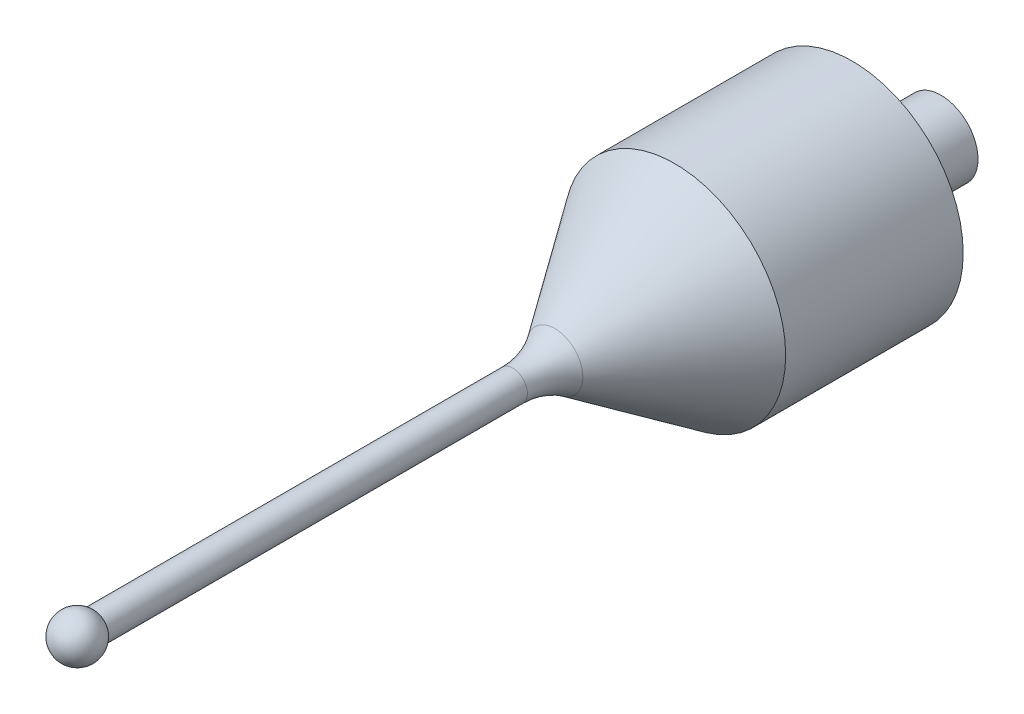
ISO-10303-21;
HEADER;
FILE_DESCRIPTION(('STEP AP214'),'2;1');
FILE_NAME('part.step','',(''),(''),'','','');
FILE_SCHEMA(('AUTOMOTIVE_DESIGN { 1 0 10303 214 1 1 1 1 }'));
ENDSEC;
DATA;
#1=APPLICATION_CONTEXT('core data for automotive mechanical design processes');
#2=APPLICATION_PROTOCOL_DEFINITION('international standard','automotive_design',2000,#1);
#3=PRODUCT_CONTEXT('',#1,'mechanical');
#4=PRODUCT('Part','Part','',(#3));
#5=PRODUCT_RELATED_PRODUCT_CATEGORY('part','',(#4));
#6=PRODUCT_DEFINITION_FORMATION('','',#4);
#7=PRODUCT_DEFINITION_CONTEXT('part definition',#1,'design');
#8=PRODUCT_DEFINITION('design','',#6,#7);
#9=PRODUCT_DEFINITION_SHAPE('','',#8);
#10=(LENGTH_UNIT() NAMED_UNIT(*) SI_UNIT(.MILLI.,.METRE.));
#11=(NAMED_UNIT(*) PLANE_ANGLE_UNIT() SI_UNIT($,.RADIAN.));
#12=(NAMED_UNIT(*) SI_UNIT($,.STERADIAN.) SOLID_ANGLE_UNIT());
#13=UNCERTAINTY_MEASURE_WITH_UNIT(LENGTH_MEASURE(1.E-05),#10,'distance_accuracy_value','');
#14=(GEOMETRIC_REPRESENTATION_CONTEXT(3) GLOBAL_UNCERTAINTY_ASSIGNED_CONTEXT((#13)) GLOBAL_UNIT_ASSIGNED_CONTEXT((#10,
#11,#12)) REPRESENTATION_CONTEXT('',''));
#15=CARTESIAN_POINT('',(0.,0.,0.));
#16=DIRECTION('',(0.,0.,1.));
#17=DIRECTION('',(1.,0.,0.));
#18=AXIS2_PLACEMENT_3D('',#15,#16,#17);
#19=CARTESIAN_POINT('',(0.,0.,45.4607142857143));
#20=DIRECTION('',(0.,0.,-1.));
#21=DIRECTION('',(-1.,0.,0.));
#22=AXIS2_PLACEMENT_3D('',#19,#20,#21);
#23=CYLINDRICAL_SURFACE('',#22,1.);
#24=CARTESIAN_POINT('',(0.,0.,17.0230309921772));
#25=DIRECTION('',(0.,0.,1.));
#26=DIRECTION('',(1.,0.,0.));
#27=AXIS2_PLACEMENT_3D('',#24,#25,#26);
#28=CIRCLE('',#27,1.);
#29=CARTESIAN_POINT('',(1.,0.,17.0230309921772));
#30=VERTEX_POINT('',#29);
#31=EDGE_CURVE('E50',#30,#30,#28,.T.);
#32=ORIENTED_EDGE('',*,*,#31,.T.);
#33=EDGE_LOOP('',(#32));
#34=FACE_BOUND('',#33,.T.);
#35=CARTESIAN_POINT('',(0.,0.,45.3426802969644));
#36=DIRECTION('',(0.,0.,0.999999999999997));
#37=DIRECTION('',(1.,0.,0.));
#38=AXIS2_PLACEMENT_3D('',#35,#36,#37);
#39=CIRCLE('',#38,1.);
#40=CARTESIAN_POINT('',(1.,0.,45.3426802969644));
#41=VERTEX_POINT('',#40);
#42=EDGE_CURVE('E10',#41,#41,#39,.T.);
#43=ORIENTED_EDGE('',*,*,#42,.F.);
#44=EDGE_LOOP('',(#43));
#45=FACE_BOUND('',#44,.T.);
#46=ADVANCED_FACE('F37',(#34,#45),#23,.T.);
#47=CARTESIAN_POINT('',(0.,0.,-11.925));
#48=DIRECTION('',(0.,0.,-1.));
#49=DIRECTION('',(-1.,0.,0.));
#50=AXIS2_PLACEMENT_3D('',#47,#48,#49);
#51=PLANE('',#50);
#52=CARTESIAN_POINT('',(0.,0.,-11.925));
#53=DIRECTION('',(0.,0.,1.));
#54=DIRECTION('',(1.,0.,0.));
#55=AXIS2_PLACEMENT_3D('',#52,#53,#54);
#56=CIRCLE('',#55,2.5);
#57=CARTESIAN_POINT('',(2.5,0.,-11.925));
#58=VERTEX_POINT('',#57);
#59=EDGE_CURVE('E55',#58,#58,#56,.T.);
#60=ORIENTED_EDGE('',*,*,#59,.F.);
#61=EDGE_LOOP('',(#60));
#62=FACE_BOUND('',#61,.T.);
#63=ADVANCED_FACE('F90',(#62),#51,.T.);
#64=CARTESIAN_POINT('',(0.,0.,0.));
#65=DIRECTION('',(0.,0.,1.));
#66=DIRECTION('',(1.,0.,0.));
#67=AXIS2_PLACEMENT_3D('',#64,#65,#66);
#68=CYLINDRICAL_SURFACE('',#67,2.5);
#69=ORIENTED_EDGE('',*,*,#59,.T.);
#70=EDGE_LOOP('',(#69));
#71=FACE_BOUND('',#70,.T.);
#72=CARTESIAN_POINT('',(0.,0.,-5.92499999999997));
#73=DIRECTION('',(0.,0.,1.));
#74=DIRECTION('',(1.,0.,0.));
#75=AXIS2_PLACEMENT_3D('',#72,#73,#74);
#76=CIRCLE('',#75,2.5);
#77=CARTESIAN_POINT('',(2.5,0.,-5.92499999999997));
#78=VERTEX_POINT('',#77);
#79=EDGE_CURVE('E61',#78,#78,#76,.T.);
#80=ORIENTED_EDGE('',*,*,#79,.F.);
#81=EDGE_LOOP('',(#80));
#82=FACE_BOUND('',#81,.T.);
#83=ADVANCED_FACE('F86',(#71,#82),#68,.T.);
#84=CARTESIAN_POINT('',(2.5,0.,-5.92499999999997));
#85=DIRECTION('',(0.,0.,-1.));
#86=DIRECTION('',(-1.,0.,0.));
#87=AXIS2_PLACEMENT_3D('',#84,#85,#86);
#88=PLANE('',#87);
#89=ORIENTED_EDGE('',*,*,#79,.T.);
#90=EDGE_LOOP('',(#89));
#91=FACE_BOUND('',#90,.T.);
#92=CARTESIAN_POINT('',(0.,0.,-5.92499999999997));
#93=DIRECTION('',(0.,0.,1.));
#94=DIRECTION('',(1.,0.,0.));
#95=AXIS2_PLACEMENT_3D('',#92,#93,#94);
#96=CIRCLE('',#95,7.5);
#97=CARTESIAN_POINT('',(7.5,0.,-5.92499999999997));
#98=VERTEX_POINT('',#97);
#99=EDGE_CURVE('E65',#98,#98,#96,.T.);
#100=ORIENTED_EDGE('',*,*,#99,.F.);
#101=EDGE_LOOP('',(#100));
#102=FACE_BOUND('',#101,.T.);
#103=ADVANCED_FACE('F78',(#91,#102),#88,.T.);
#104=CARTESIAN_POINT('',(0.,0.,0.));
#105=DIRECTION('',(0.,0.,1.));
#106=DIRECTION('',(1.,0.,0.));
#107=AXIS2_PLACEMENT_3D('',#104,#105,#106);
#108=CYLINDRICAL_SURFACE('',#107,7.5);
#109=ORIENTED_EDGE('',*,*,#99,.T.);
#110=EDGE_LOOP('',(#109));
#111=FACE_BOUND('',#110,.T.);
#112=CARTESIAN_POINT('',(0.,0.,6.07500000000003));
#113=DIRECTION('',(0.,0.,1.));
#114=DIRECTION('',(1.,0.,0.));
#115=AXIS2_PLACEMENT_3D('',#112,#113,#114);
#116=CIRCLE('',#115,7.5);
#117=CARTESIAN_POINT('',(7.5,0.,6.07500000000003));
#118=VERTEX_POINT('',#117);
#119=EDGE_CURVE('E69',#118,#118,#116,.T.);
#120=ORIENTED_EDGE('',*,*,#119,.F.);
#121=EDGE_LOOP('',(#120));
#122=FACE_BOUND('',#121,.T.);
#123=ADVANCED_FACE('F76',(#111,#122),#108,.T.);
#124=CARTESIAN_POINT('',(0.,0.,15.4607142857143));
#125=DIRECTION('',(0.,0.,-1.));
#126=DIRECTION('',(-1.,0.,0.));
#127=AXIS2_PLACEMENT_3D('',#124,#125,#126);
#128=CONICAL_SURFACE('',#127,1.,0.605702941539705);
#129=CARTESIAN_POINT('',(0.,0.,14.1763304592677));
#130=DIRECTION('',(0.,0.,1.));
#131=DIRECTION('',(1.,0.,0.));
#132=AXIS2_PLACEMENT_3D('',#129,#130,#131);
#133=CIRCLE('',#132,1.88948956017233);
#134=CARTESIAN_POINT('',(1.88948956017233,0.,14.1763304592677));
#135=VERTEX_POINT('',#134);
#136=EDGE_CURVE('E45',#135,#135,#133,.F.);
#137=ORIENTED_EDGE('',*,*,#136,.T.);
#138=EDGE_LOOP('',(#137));
#139=FACE_BOUND('',#138,.T.);
#140=ORIENTED_EDGE('',*,*,#119,.T.);
#141=EDGE_LOOP('',(#140));
#142=FACE_BOUND('',#141,.T.);
#143=ADVANCED_FACE('F74',(#139,#142),#128,.T.);
#144=CARTESIAN_POINT('',(0.,0.,17.0230309921772));
#145=DIRECTION('',(0.,0.,1.));
#146=DIRECTION('',(1.,0.,0.));
#147=AXIS2_PLACEMENT_3D('',#144,#145,#146);
#148=TOROIDAL_SURFACE('',#147,6.,5.);
#149=ORIENTED_EDGE('',*,*,#136,.F.);
#150=EDGE_LOOP('',(#149));
#151=FACE_BOUND('',#150,.T.);
#152=ORIENTED_EDGE('',*,*,#31,.F.);
#153=EDGE_LOOP('',(#152));
#154=FACE_BOUND('',#153,.T.);
#155=ADVANCED_FACE('F39',(#151,#154),#148,.F.);
#156=CARTESIAN_POINT('',(0.,0.,46.4607142857143));
#157=DIRECTION('',(-1.,0.,0.));
#158=DIRECTION('',(0.,-1.,0.));
#159=AXIS2_PLACEMENT_3D('',#156,#157,#158);
#160=SPHERICAL_SURFACE('',#159,1.5);
#161=CARTESIAN_POINT('',(0.,0.,46.4607142857143));
#162=DIRECTION('',(0.,0.,1.));
#163=DIRECTION('',(1.,0.,0.));
#164=AXIS2_PLACEMENT_3D('',#161,#162,#163);
#165=SPHERICAL_SURFACE('',#164,1.5);
#166=ORIENTED_EDGE('',*,*,#42,.T.);
#167=EDGE_LOOP('',(#166));
#168=FACE_BOUND('',#167,.T.);
#169=ADVANCED_FACE('F99',(#168),#165,.T.);
#170=CLOSED_SHELL('',(#46,#63,#83,#103,#123,#143,#155,#169));
#171=MANIFOLD_SOLID_BREP('B2',#170);
#172=ADVANCED_BREP_SHAPE_REPRESENTATION('',(#18,#171),#14);
#173=SHAPE_DEFINITION_REPRESENTATION(#9,#172);
ENDSEC;
END-ISO-10303-21;
